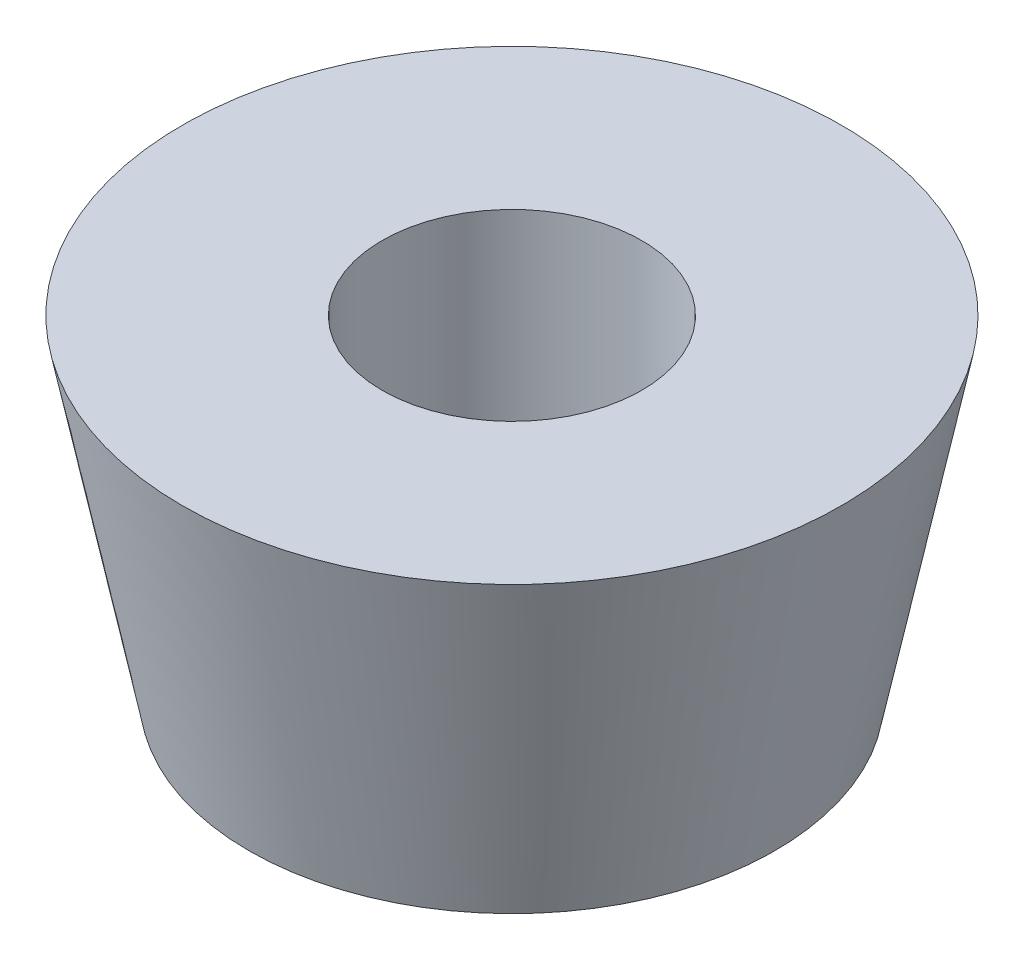
ISO-10303-21;
HEADER;
FILE_DESCRIPTION(('STEP AP214'),'2;1');
FILE_NAME('part.step','',(''),(''),'','','');
FILE_SCHEMA(('AUTOMOTIVE_DESIGN { 1 0 10303 214 1 1 1 1 }'));
ENDSEC;
DATA;
#1=APPLICATION_CONTEXT('core data for automotive mechanical design processes');
#2=APPLICATION_PROTOCOL_DEFINITION('international standard','automotive_design',2000,#1);
#3=PRODUCT_CONTEXT('',#1,'mechanical');
#4=PRODUCT('Part','Part','',(#3));
#5=PRODUCT_RELATED_PRODUCT_CATEGORY('part','',(#4));
#6=PRODUCT_DEFINITION_FORMATION('','',#4);
#7=PRODUCT_DEFINITION_CONTEXT('part definition',#1,'design');
#8=PRODUCT_DEFINITION('design','',#6,#7);
#9=PRODUCT_DEFINITION_SHAPE('','',#8);
#10=(LENGTH_UNIT() NAMED_UNIT(*) SI_UNIT(.MILLI.,.METRE.));
#11=(NAMED_UNIT(*) PLANE_ANGLE_UNIT() SI_UNIT($,.RADIAN.));
#12=(NAMED_UNIT(*) SI_UNIT($,.STERADIAN.) SOLID_ANGLE_UNIT());
#13=UNCERTAINTY_MEASURE_WITH_UNIT(LENGTH_MEASURE(1.E-05),#10,'distance_accuracy_value','');
#14=(GEOMETRIC_REPRESENTATION_CONTEXT(3) GLOBAL_UNCERTAINTY_ASSIGNED_CONTEXT((#13)) GLOBAL_UNIT_ASSIGNED_CONTEXT((#10,
#11,#12)) REPRESENTATION_CONTEXT('',''));
#15=CARTESIAN_POINT('',(0.,0.,0.));
#16=DIRECTION('',(0.,0.,1.));
#17=DIRECTION('',(1.,0.,0.));
#18=AXIS2_PLACEMENT_3D('',#15,#16,#17);
#19=CARTESIAN_POINT('',(4.95,0.,0.));
#20=DIRECTION('',(0.,-1.,0.));
#21=DIRECTION('',(0.,0.,-1.));
#22=AXIS2_PLACEMENT_3D('',#19,#20,#21);
#23=PLANE('',#22);
#24=CARTESIAN_POINT('',(0.,0.,0.));
#25=DIRECTION('',(0.,1.,0.));
#26=DIRECTION('',(0.,0.,1.));
#27=AXIS2_PLACEMENT_3D('',#24,#25,#26);
#28=CIRCLE('',#27,1.95);
#29=CARTESIAN_POINT('',(0.,0.,1.95));
#30=VERTEX_POINT('',#29);
#31=EDGE_CURVE('E10',#30,#30,#28,.T.);
#32=ORIENTED_EDGE('',*,*,#31,.F.);
#33=EDGE_LOOP('',(#32));
#34=FACE_BOUND('',#33,.T.);
#35=CARTESIAN_POINT('',(0.,0.,0.));
#36=DIRECTION('',(0.,1.,0.));
#37=DIRECTION('',(0.,0.,1.));
#38=AXIS2_PLACEMENT_3D('',#35,#36,#37);
#39=CIRCLE('',#38,4.95);
#40=CARTESIAN_POINT('',(0.,0.,4.95));
#41=VERTEX_POINT('',#40);
#42=EDGE_CURVE('E45',#41,#41,#39,.T.);
#43=ORIENTED_EDGE('',*,*,#42,.T.);
#44=EDGE_LOOP('',(#43));
#45=FACE_BOUND('',#44,.T.);
#46=ADVANCED_FACE('F31',(#34,#45),#23,.F.);
#47=CARTESIAN_POINT('',(0.,0.,0.));
#48=DIRECTION('',(0.,1.,0.));
#49=DIRECTION('',(0.,0.,1.));
#50=AXIS2_PLACEMENT_3D('',#47,#48,#49);
#51=CYLINDRICAL_SURFACE('',#50,1.95);
#52=CARTESIAN_POINT('',(0.,-4.98879104637149,0.));
#53=DIRECTION('',(0.,1.,0.));
#54=DIRECTION('',(0.,0.,1.));
#55=AXIS2_PLACEMENT_3D('',#52,#53,#54);
#56=CIRCLE('',#55,1.95);
#57=CARTESIAN_POINT('',(0.,-4.98879104637149,1.95));
#58=VERTEX_POINT('',#57);
#59=EDGE_CURVE('E37',#58,#58,#56,.T.);
#60=ORIENTED_EDGE('',*,*,#59,.F.);
#61=EDGE_LOOP('',(#60));
#62=FACE_BOUND('',#61,.T.);
#63=ORIENTED_EDGE('',*,*,#31,.T.);
#64=EDGE_LOOP('',(#63));
#65=FACE_BOUND('',#64,.T.);
#66=ADVANCED_FACE('F60',(#62,#65),#51,.F.);
#67=CARTESIAN_POINT('',(1.95,-4.98879104637149,0.));
#68=DIRECTION('',(0.,1.,0.));
#69=DIRECTION('',(0.,0.,1.));
#70=AXIS2_PLACEMENT_3D('',#67,#68,#69);
#71=PLANE('',#70);
#72=CARTESIAN_POINT('',(0.,-4.98879104637149,0.));
#73=DIRECTION('',(0.,1.,0.));
#74=DIRECTION('',(0.,0.,1.));
#75=AXIS2_PLACEMENT_3D('',#72,#73,#74);
#76=CIRCLE('',#75,3.95);
#77=CARTESIAN_POINT('',(0.,-4.98879104637149,3.95));
#78=VERTEX_POINT('',#77);
#79=EDGE_CURVE('E41',#78,#78,#76,.T.);
#80=ORIENTED_EDGE('',*,*,#79,.F.);
#81=EDGE_LOOP('',(#80));
#82=FACE_BOUND('',#81,.T.);
#83=ORIENTED_EDGE('',*,*,#59,.T.);
#84=EDGE_LOOP('',(#83));
#85=FACE_BOUND('',#84,.T.);
#86=ADVANCED_FACE('F55',(#82,#85),#71,.F.);
#87=CARTESIAN_POINT('',(0.,-4.98879104637149,0.));
#88=DIRECTION('',(0.,1.,0.));
#89=DIRECTION('',(0.,0.,1.));
#90=AXIS2_PLACEMENT_3D('',#87,#88,#89);
#91=CONICAL_SURFACE('',#90,3.95,0.197827604726265);
#92=ORIENTED_EDGE('',*,*,#42,.F.);
#93=EDGE_LOOP('',(#92));
#94=FACE_BOUND('',#93,.T.);
#95=ORIENTED_EDGE('',*,*,#79,.T.);
#96=EDGE_LOOP('',(#95));
#97=FACE_BOUND('',#96,.T.);
#98=ADVANCED_FACE('F52',(#94,#97),#91,.T.);
#99=CLOSED_SHELL('',(#46,#66,#86,#98));
#100=MANIFOLD_SOLID_BREP('B2',#99);
#101=ADVANCED_BREP_SHAPE_REPRESENTATION('',(#18,#100),#14);
#102=SHAPE_DEFINITION_REPRESENTATION(#9,#101);
ENDSEC;
END-ISO-10303-21;
